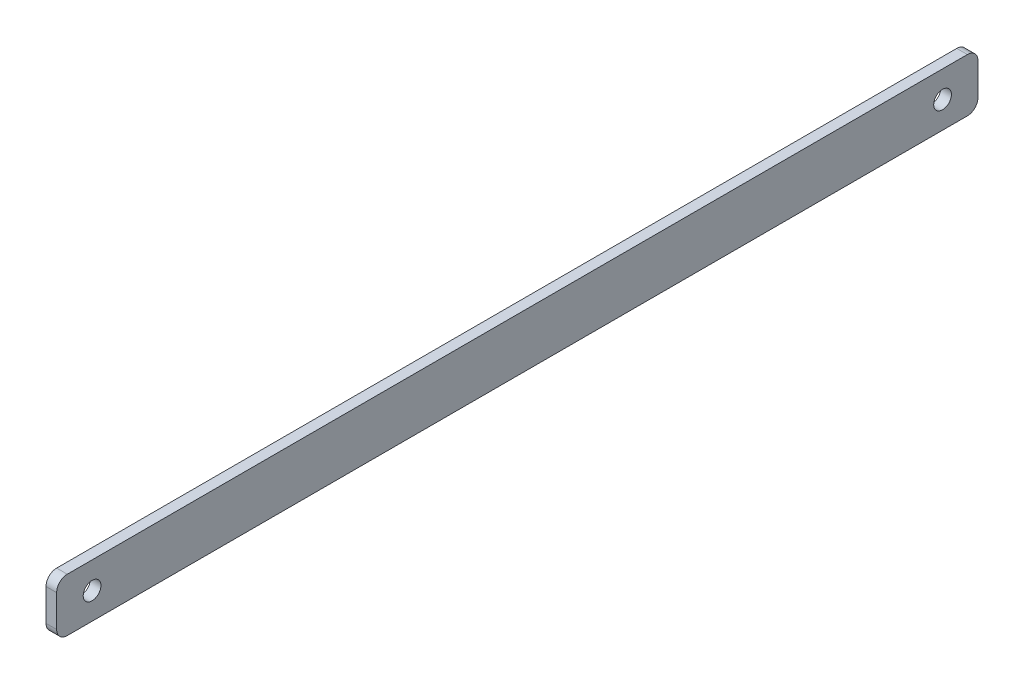
ISO-10303-21;
HEADER;
FILE_DESCRIPTION(('STEP AP214'),'2;1');
FILE_NAME('part.step','',(''),(''),'','','');
FILE_SCHEMA(('AUTOMOTIVE_DESIGN { 1 0 10303 214 1 1 1 1 }'));
ENDSEC;
DATA;
#1=APPLICATION_CONTEXT('core data for automotive mechanical design processes');
#2=APPLICATION_PROTOCOL_DEFINITION('international standard','automotive_design',2000,#1);
#3=PRODUCT_CONTEXT('',#1,'mechanical');
#4=PRODUCT('Part','Part','',(#3));
#5=PRODUCT_RELATED_PRODUCT_CATEGORY('part','',(#4));
#6=PRODUCT_DEFINITION_FORMATION('','',#4);
#7=PRODUCT_DEFINITION_CONTEXT('part definition',#1,'design');
#8=PRODUCT_DEFINITION('design','',#6,#7);
#9=PRODUCT_DEFINITION_SHAPE('','',#8);
#10=(LENGTH_UNIT() NAMED_UNIT(*) SI_UNIT(.MILLI.,.METRE.));
#11=(NAMED_UNIT(*) PLANE_ANGLE_UNIT() SI_UNIT($,.RADIAN.));
#12=(NAMED_UNIT(*) SI_UNIT($,.STERADIAN.) SOLID_ANGLE_UNIT());
#13=UNCERTAINTY_MEASURE_WITH_UNIT(LENGTH_MEASURE(1.E-05),#10,'distance_accuracy_value','');
#14=(GEOMETRIC_REPRESENTATION_CONTEXT(3) GLOBAL_UNCERTAINTY_ASSIGNED_CONTEXT((#13)) GLOBAL_UNIT_ASSIGNED_CONTEXT((#10,
#11,#12)) REPRESENTATION_CONTEXT('',''));
#15=CARTESIAN_POINT('',(0.,0.,0.));
#16=DIRECTION('',(0.,0.,1.));
#17=DIRECTION('',(1.,0.,0.));
#18=AXIS2_PLACEMENT_3D('',#15,#16,#17);
#19=CARTESIAN_POINT('',(3.,-4.5,127.));
#20=DIRECTION('',(1.,0.,0.));
#21=DIRECTION('',(0.,0.,-1.));
#22=AXIS2_PLACEMENT_3D('',#19,#20,#21);
#23=PLANE('',#22);
#24=CARTESIAN_POINT('',(3.,0.,120.));
#25=DIRECTION('',(1.,0.,0.));
#26=DIRECTION('',(0.,0.,-1.));
#27=AXIS2_PLACEMENT_3D('',#24,#25,#26);
#28=CIRCLE('',#27,2.49999999999999);
#29=CARTESIAN_POINT('',(3.,0.,117.5));
#30=VERTEX_POINT('',#29);
#31=EDGE_CURVE('E136',#30,#30,#28,.T.);
#32=ORIENTED_EDGE('',*,*,#31,.F.);
#33=EDGE_LOOP('',(#32));
#34=FACE_BOUND('',#33,.T.);
#35=CARTESIAN_POINT('',(3.,-4.5,127.));
#36=DIRECTION('',(1.,0.,0.));
#37=DIRECTION('',(0.,0.,-1.));
#38=AXIS2_PLACEMENT_3D('',#35,#36,#37);
#39=CIRCLE('',#38,3.);
#40=CARTESIAN_POINT('',(3.,-4.5,130.));
#41=VERTEX_POINT('',#40);
#42=CARTESIAN_POINT('',(3.,-7.5,127.));
#43=VERTEX_POINT('',#42);
#44=EDGE_CURVE('E147',#41,#43,#39,.T.);
#45=ORIENTED_EDGE('',*,*,#44,.T.);
#46=DIRECTION('',(0.,0.,-1.));
#47=VECTOR('',#46,1.);
#48=CARTESIAN_POINT('',(3.,-7.5,127.));
#49=LINE('',#48,#47);
#50=CARTESIAN_POINT('',(3.,-7.5,-127.));
#51=VERTEX_POINT('',#50);
#52=EDGE_CURVE('E95',#43,#51,#49,.T.);
#53=ORIENTED_EDGE('',*,*,#52,.T.);
#54=CARTESIAN_POINT('',(3.,-4.5,-127.));
#55=DIRECTION('',(1.,0.,0.));
#56=DIRECTION('',(0.,0.,-1.));
#57=AXIS2_PLACEMENT_3D('',#54,#55,#56);
#58=CIRCLE('',#57,3.);
#59=CARTESIAN_POINT('',(3.,-4.5,-130.));
#60=VERTEX_POINT('',#59);
#61=EDGE_CURVE('E162',#51,#60,#58,.T.);
#62=ORIENTED_EDGE('',*,*,#61,.T.);
#63=DIRECTION('',(0.,1.,0.));
#64=VECTOR('',#63,1.);
#65=CARTESIAN_POINT('',(3.,4.5,-130.));
#66=LINE('',#65,#64);
#67=CARTESIAN_POINT('',(3.,4.5,-130.));
#68=VERTEX_POINT('',#67);
#69=EDGE_CURVE('E175',#60,#68,#66,.T.);
#70=ORIENTED_EDGE('',*,*,#69,.T.);
#71=CARTESIAN_POINT('',(3.,4.5,-127.));
#72=DIRECTION('',(1.,0.,0.));
#73=DIRECTION('',(0.,0.,1.));
#74=AXIS2_PLACEMENT_3D('',#71,#72,#73);
#75=CIRCLE('',#74,3.00000000000002);
#76=CARTESIAN_POINT('',(3.,7.5,-127.));
#77=VERTEX_POINT('',#76);
#78=EDGE_CURVE('E114',#68,#77,#75,.T.);
#79=ORIENTED_EDGE('',*,*,#78,.T.);
#80=DIRECTION('',(0.,0.,1.));
#81=VECTOR('',#80,1.);
#82=CARTESIAN_POINT('',(3.,7.5,127.));
#83=LINE('',#82,#81);
#84=CARTESIAN_POINT('',(3.,7.5,127.));
#85=VERTEX_POINT('',#84);
#86=EDGE_CURVE('E108',#77,#85,#83,.T.);
#87=ORIENTED_EDGE('',*,*,#86,.T.);
#88=CARTESIAN_POINT('',(3.,4.5,127.));
#89=DIRECTION('',(1.,0.,0.));
#90=DIRECTION('',(0.,0.,-1.));
#91=AXIS2_PLACEMENT_3D('',#88,#89,#90);
#92=CIRCLE('',#91,3.);
#93=CARTESIAN_POINT('',(3.,4.5,130.));
#94=VERTEX_POINT('',#93);
#95=EDGE_CURVE('E112',#85,#94,#92,.T.);
#96=ORIENTED_EDGE('',*,*,#95,.T.);
#97=DIRECTION('',(0.,-1.,0.));
#98=VECTOR('',#97,1.);
#99=CARTESIAN_POINT('',(3.,4.5,130.));
#100=LINE('',#99,#98);
#101=EDGE_CURVE('E52',#94,#41,#100,.T.);
#102=ORIENTED_EDGE('',*,*,#101,.T.);
#103=EDGE_LOOP('',(#45,#53,#62,#70,#79,#87,#96,#102));
#104=FACE_BOUND('',#103,.T.);
#105=CARTESIAN_POINT('',(3.,0.,-120.));
#106=DIRECTION('',(1.,0.,0.));
#107=DIRECTION('',(0.,0.,1.));
#108=AXIS2_PLACEMENT_3D('',#105,#106,#107);
#109=CIRCLE('',#108,2.49999999999999);
#110=CARTESIAN_POINT('',(3.,0.,-117.5));
#111=VERTEX_POINT('',#110);
#112=EDGE_CURVE('E184',#111,#111,#109,.T.);
#113=ORIENTED_EDGE('',*,*,#112,.F.);
#114=EDGE_LOOP('',(#113));
#115=FACE_BOUND('',#114,.T.);
#116=ADVANCED_FACE('F35',(#34,#104,#115),#23,.T.);
#117=CARTESIAN_POINT('',(0.,-4.5,127.));
#118=DIRECTION('',(1.,0.,0.));
#119=DIRECTION('',(0.,0.,-1.));
#120=AXIS2_PLACEMENT_3D('',#117,#118,#119);
#121=PLANE('',#120);
#122=CARTESIAN_POINT('',(0.,-4.5,127.));
#123=DIRECTION('',(1.,0.,0.));
#124=DIRECTION('',(0.,0.,-1.));
#125=AXIS2_PLACEMENT_3D('',#122,#123,#124);
#126=CIRCLE('',#125,3.);
#127=CARTESIAN_POINT('',(0.,-4.5,130.));
#128=VERTEX_POINT('',#127);
#129=CARTESIAN_POINT('',(0.,-7.5,127.));
#130=VERTEX_POINT('',#129);
#131=EDGE_CURVE('E132',#128,#130,#126,.T.);
#132=ORIENTED_EDGE('',*,*,#131,.F.);
#133=DIRECTION('',(0.,-1.,0.));
#134=VECTOR('',#133,1.);
#135=CARTESIAN_POINT('',(0.,4.5,130.));
#136=LINE('',#135,#134);
#137=CARTESIAN_POINT('',(0.,4.5,130.));
#138=VERTEX_POINT('',#137);
#139=EDGE_CURVE('E87',#138,#128,#136,.T.);
#140=ORIENTED_EDGE('',*,*,#139,.F.);
#141=CARTESIAN_POINT('',(0.,4.5,127.));
#142=DIRECTION('',(1.,0.,0.));
#143=DIRECTION('',(0.,0.,-1.));
#144=AXIS2_PLACEMENT_3D('',#141,#142,#143);
#145=CIRCLE('',#144,3.);
#146=CARTESIAN_POINT('',(0.,7.5,127.));
#147=VERTEX_POINT('',#146);
#148=EDGE_CURVE('E81',#147,#138,#145,.T.);
#149=ORIENTED_EDGE('',*,*,#148,.F.);
#150=DIRECTION('',(0.,0.,1.));
#151=VECTOR('',#150,1.);
#152=CARTESIAN_POINT('',(0.,7.5,127.));
#153=LINE('',#152,#151);
#154=CARTESIAN_POINT('',(0.,7.5,-127.));
#155=VERTEX_POINT('',#154);
#156=EDGE_CURVE('E122',#155,#147,#153,.T.);
#157=ORIENTED_EDGE('',*,*,#156,.F.);
#158=CARTESIAN_POINT('',(0.,4.5,-127.));
#159=DIRECTION('',(1.,0.,0.));
#160=DIRECTION('',(0.,0.,1.));
#161=AXIS2_PLACEMENT_3D('',#158,#159,#160);
#162=CIRCLE('',#161,3.00000000000002);
#163=CARTESIAN_POINT('',(0.,4.5,-130.));
#164=VERTEX_POINT('',#163);
#165=EDGE_CURVE('E142',#164,#155,#162,.T.);
#166=ORIENTED_EDGE('',*,*,#165,.F.);
#167=DIRECTION('',(0.,1.,0.));
#168=VECTOR('',#167,1.);
#169=CARTESIAN_POINT('',(0.,4.5,-130.));
#170=LINE('',#169,#168);
#171=CARTESIAN_POINT('',(0.,-4.5,-130.));
#172=VERTEX_POINT('',#171);
#173=EDGE_CURVE('E140',#172,#164,#170,.T.);
#174=ORIENTED_EDGE('',*,*,#173,.F.);
#175=CARTESIAN_POINT('',(0.,-4.5,-127.));
#176=DIRECTION('',(1.,0.,0.));
#177=DIRECTION('',(0.,0.,-1.));
#178=AXIS2_PLACEMENT_3D('',#175,#176,#177);
#179=CIRCLE('',#178,3.);
#180=CARTESIAN_POINT('',(0.,-7.5,-127.));
#181=VERTEX_POINT('',#180);
#182=EDGE_CURVE('E138',#181,#172,#179,.T.);
#183=ORIENTED_EDGE('',*,*,#182,.F.);
#184=DIRECTION('',(0.,0.,-1.));
#185=VECTOR('',#184,1.);
#186=CARTESIAN_POINT('',(0.,-7.5,127.));
#187=LINE('',#186,#185);
#188=EDGE_CURVE('E135',#130,#181,#187,.T.);
#189=ORIENTED_EDGE('',*,*,#188,.F.);
#190=EDGE_LOOP('',(#132,#140,#149,#157,#166,#174,#183,#189));
#191=FACE_BOUND('',#190,.T.);
#192=CARTESIAN_POINT('',(0.,0.,120.));
#193=DIRECTION('',(1.,0.,0.));
#194=DIRECTION('',(0.,0.,-1.));
#195=AXIS2_PLACEMENT_3D('',#192,#193,#194);
#196=CIRCLE('',#195,2.49999999999999);
#197=CARTESIAN_POINT('',(0.,0.,117.5));
#198=VERTEX_POINT('',#197);
#199=EDGE_CURVE('E181',#198,#198,#196,.T.);
#200=ORIENTED_EDGE('',*,*,#199,.T.);
#201=EDGE_LOOP('',(#200));
#202=FACE_BOUND('',#201,.T.);
#203=CARTESIAN_POINT('',(0.,0.,-120.));
#204=DIRECTION('',(1.,0.,0.));
#205=DIRECTION('',(0.,0.,1.));
#206=AXIS2_PLACEMENT_3D('',#203,#204,#205);
#207=CIRCLE('',#206,2.49999999999999);
#208=CARTESIAN_POINT('',(0.,0.,-117.5));
#209=VERTEX_POINT('',#208);
#210=EDGE_CURVE('E187',#209,#209,#207,.T.);
#211=ORIENTED_EDGE('',*,*,#210,.T.);
#212=EDGE_LOOP('',(#211));
#213=FACE_BOUND('',#212,.T.);
#214=ADVANCED_FACE('F166',(#191,#202,#213),#121,.F.);
#215=CARTESIAN_POINT('',(3.,-4.5,127.));
#216=DIRECTION('',(-1.,0.,0.));
#217=DIRECTION('',(0.,0.,1.));
#218=AXIS2_PLACEMENT_3D('',#215,#216,#217);
#219=CYLINDRICAL_SURFACE('',#218,3.);
#220=ORIENTED_EDGE('',*,*,#131,.T.);
#221=DIRECTION('',(-1.,0.,0.));
#222=VECTOR('',#221,1.);
#223=CARTESIAN_POINT('',(3.,-7.5,127.));
#224=LINE('',#223,#222);
#225=EDGE_CURVE('E11',#43,#130,#224,.T.);
#226=ORIENTED_EDGE('',*,*,#225,.F.);
#227=ORIENTED_EDGE('',*,*,#44,.F.);
#228=DIRECTION('',(-1.,0.,0.));
#229=VECTOR('',#228,1.);
#230=CARTESIAN_POINT('',(3.,-4.5,130.));
#231=LINE('',#230,#229);
#232=EDGE_CURVE('E128',#41,#128,#231,.T.);
#233=ORIENTED_EDGE('',*,*,#232,.T.);
#234=EDGE_LOOP('',(#220,#226,#227,#233));
#235=FACE_BOUND('',#234,.T.);
#236=ADVANCED_FACE('F37',(#235),#219,.T.);
#237=CARTESIAN_POINT('',(3.,-7.5,127.));
#238=DIRECTION('',(0.,1.,0.));
#239=DIRECTION('',(0.,0.,1.));
#240=AXIS2_PLACEMENT_3D('',#237,#238,#239);
#241=PLANE('',#240);
#242=ORIENTED_EDGE('',*,*,#188,.T.);
#243=DIRECTION('',(-1.,0.,0.));
#244=VECTOR('',#243,1.);
#245=CARTESIAN_POINT('',(3.,-7.5,-127.));
#246=LINE('',#245,#244);
#247=EDGE_CURVE('E44',#51,#181,#246,.T.);
#248=ORIENTED_EDGE('',*,*,#247,.F.);
#249=ORIENTED_EDGE('',*,*,#52,.F.);
#250=ORIENTED_EDGE('',*,*,#225,.T.);
#251=EDGE_LOOP('',(#242,#248,#249,#250));
#252=FACE_BOUND('',#251,.T.);
#253=ADVANCED_FACE('F219',(#252),#241,.F.);
#254=CARTESIAN_POINT('',(3.,-4.5,-127.));
#255=DIRECTION('',(-1.,0.,0.));
#256=DIRECTION('',(0.,0.,1.));
#257=AXIS2_PLACEMENT_3D('',#254,#255,#256);
#258=CYLINDRICAL_SURFACE('',#257,3.);
#259=ORIENTED_EDGE('',*,*,#182,.T.);
#260=DIRECTION('',(-1.,0.,0.));
#261=VECTOR('',#260,1.);
#262=CARTESIAN_POINT('',(3.,-4.5,-130.));
#263=LINE('',#262,#261);
#264=EDGE_CURVE('E154',#60,#172,#263,.T.);
#265=ORIENTED_EDGE('',*,*,#264,.F.);
#266=ORIENTED_EDGE('',*,*,#61,.F.);
#267=ORIENTED_EDGE('',*,*,#247,.T.);
#268=EDGE_LOOP('',(#259,#265,#266,#267));
#269=FACE_BOUND('',#268,.T.);
#270=ADVANCED_FACE('F160',(#269),#258,.T.);
#271=CARTESIAN_POINT('',(3.,4.5,-130.));
#272=DIRECTION('',(0.,0.,1.));
#273=DIRECTION('',(1.,0.,0.));
#274=AXIS2_PLACEMENT_3D('',#271,#272,#273);
#275=PLANE('',#274);
#276=ORIENTED_EDGE('',*,*,#173,.T.);
#277=DIRECTION('',(-1.,0.,0.));
#278=VECTOR('',#277,1.);
#279=CARTESIAN_POINT('',(3.,4.5,-130.));
#280=LINE('',#279,#278);
#281=EDGE_CURVE('E151',#68,#164,#280,.T.);
#282=ORIENTED_EDGE('',*,*,#281,.F.);
#283=ORIENTED_EDGE('',*,*,#69,.F.);
#284=ORIENTED_EDGE('',*,*,#264,.T.);
#285=EDGE_LOOP('',(#276,#282,#283,#284));
#286=FACE_BOUND('',#285,.T.);
#287=ADVANCED_FACE('F171',(#286),#275,.F.);
#288=CARTESIAN_POINT('',(3.,4.5,-127.));
#289=DIRECTION('',(-1.,0.,0.));
#290=DIRECTION('',(0.,0.,1.));
#291=AXIS2_PLACEMENT_3D('',#288,#289,#290);
#292=CYLINDRICAL_SURFACE('',#291,3.00000000000002);
#293=ORIENTED_EDGE('',*,*,#165,.T.);
#294=DIRECTION('',(-1.,0.,0.));
#295=VECTOR('',#294,1.);
#296=CARTESIAN_POINT('',(3.,7.5,-127.));
#297=LINE('',#296,#295);
#298=EDGE_CURVE('E123',#77,#155,#297,.T.);
#299=ORIENTED_EDGE('',*,*,#298,.F.);
#300=ORIENTED_EDGE('',*,*,#78,.F.);
#301=ORIENTED_EDGE('',*,*,#281,.T.);
#302=EDGE_LOOP('',(#293,#299,#300,#301));
#303=FACE_BOUND('',#302,.T.);
#304=ADVANCED_FACE('F174',(#303),#292,.T.);
#305=CARTESIAN_POINT('',(3.,7.5,127.));
#306=DIRECTION('',(0.,-1.,0.));
#307=DIRECTION('',(0.,0.,-1.));
#308=AXIS2_PLACEMENT_3D('',#305,#306,#307);
#309=PLANE('',#308);
#310=ORIENTED_EDGE('',*,*,#156,.T.);
#311=DIRECTION('',(-1.,0.,0.));
#312=VECTOR('',#311,1.);
#313=CARTESIAN_POINT('',(3.,7.5,127.));
#314=LINE('',#313,#312);
#315=EDGE_CURVE('E119',#85,#147,#314,.T.);
#316=ORIENTED_EDGE('',*,*,#315,.F.);
#317=ORIENTED_EDGE('',*,*,#86,.F.);
#318=ORIENTED_EDGE('',*,*,#298,.T.);
#319=EDGE_LOOP('',(#310,#316,#317,#318));
#320=FACE_BOUND('',#319,.T.);
#321=ADVANCED_FACE('F120',(#320),#309,.F.);
#322=CARTESIAN_POINT('',(3.,4.5,127.));
#323=DIRECTION('',(-1.,0.,0.));
#324=DIRECTION('',(0.,0.,1.));
#325=AXIS2_PLACEMENT_3D('',#322,#323,#324);
#326=CYLINDRICAL_SURFACE('',#325,3.);
#327=ORIENTED_EDGE('',*,*,#148,.T.);
#328=DIRECTION('',(-1.,0.,0.));
#329=VECTOR('',#328,1.);
#330=CARTESIAN_POINT('',(3.,4.5,130.));
#331=LINE('',#330,#329);
#332=EDGE_CURVE('E124',#94,#138,#331,.T.);
#333=ORIENTED_EDGE('',*,*,#332,.F.);
#334=ORIENTED_EDGE('',*,*,#95,.F.);
#335=ORIENTED_EDGE('',*,*,#315,.T.);
#336=EDGE_LOOP('',(#327,#333,#334,#335));
#337=FACE_BOUND('',#336,.T.);
#338=ADVANCED_FACE('F126',(#337),#326,.T.);
#339=CARTESIAN_POINT('',(3.,4.5,130.));
#340=DIRECTION('',(0.,0.,-1.));
#341=DIRECTION('',(-1.,0.,0.));
#342=AXIS2_PLACEMENT_3D('',#339,#340,#341);
#343=PLANE('',#342);
#344=ORIENTED_EDGE('',*,*,#139,.T.);
#345=ORIENTED_EDGE('',*,*,#232,.F.);
#346=ORIENTED_EDGE('',*,*,#101,.F.);
#347=ORIENTED_EDGE('',*,*,#332,.T.);
#348=EDGE_LOOP('',(#344,#345,#346,#347));
#349=FACE_BOUND('',#348,.T.);
#350=ADVANCED_FACE('F207',(#349),#343,.F.);
#351=CARTESIAN_POINT('',(3.,0.,120.));
#352=DIRECTION('',(-1.,0.,0.));
#353=DIRECTION('',(0.,0.,1.));
#354=AXIS2_PLACEMENT_3D('',#351,#352,#353);
#355=CYLINDRICAL_SURFACE('',#354,2.49999999999999);
#356=ORIENTED_EDGE('',*,*,#31,.T.);
#357=EDGE_LOOP('',(#356));
#358=FACE_BOUND('',#357,.T.);
#359=ORIENTED_EDGE('',*,*,#199,.F.);
#360=EDGE_LOOP('',(#359));
#361=FACE_BOUND('',#360,.T.);
#362=ADVANCED_FACE('F204',(#358,#361),#355,.F.);
#363=CARTESIAN_POINT('',(3.,0.,-120.));
#364=DIRECTION('',(-1.,0.,0.));
#365=DIRECTION('',(0.,0.,1.));
#366=AXIS2_PLACEMENT_3D('',#363,#364,#365);
#367=CYLINDRICAL_SURFACE('',#366,2.49999999999999);
#368=ORIENTED_EDGE('',*,*,#112,.T.);
#369=EDGE_LOOP('',(#368));
#370=FACE_BOUND('',#369,.T.);
#371=ORIENTED_EDGE('',*,*,#210,.F.);
#372=EDGE_LOOP('',(#371));
#373=FACE_BOUND('',#372,.T.);
#374=ADVANCED_FACE('F193',(#370,#373),#367,.F.);
#375=CLOSED_SHELL('',(#116,#214,#236,#253,#270,#287,#304,#321,#338,#350,#362,#374));
#376=MANIFOLD_SOLID_BREP('B2',#375);
#377=ADVANCED_BREP_SHAPE_REPRESENTATION('',(#18,#376),#14);
#378=SHAPE_DEFINITION_REPRESENTATION(#9,#377);
ENDSEC;
END-ISO-10303-21;
